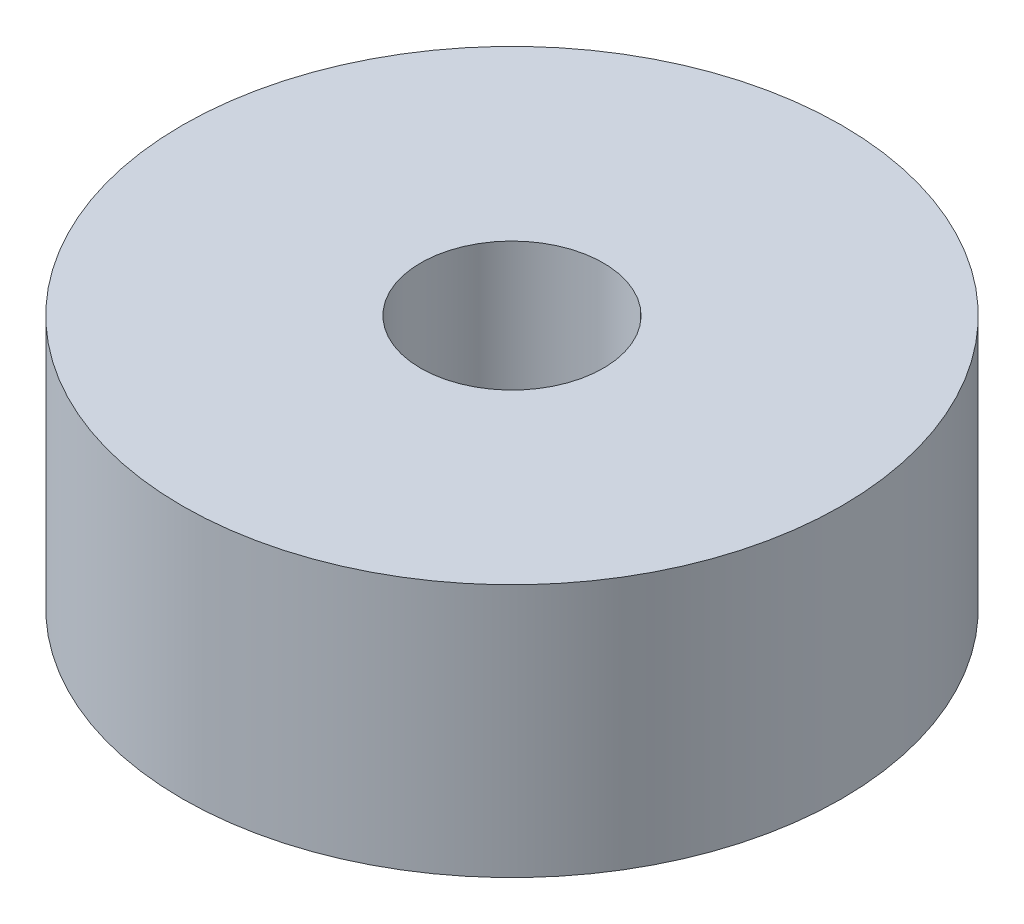
ISO-10303-21;
HEADER;
FILE_DESCRIPTION(('STEP AP214'),'2;1');
FILE_NAME('part.step','',(''),(''),'','','');
FILE_SCHEMA(('AUTOMOTIVE_DESIGN { 1 0 10303 214 1 1 1 1 }'));
ENDSEC;
DATA;
#1=APPLICATION_CONTEXT('core data for automotive mechanical design processes');
#2=APPLICATION_PROTOCOL_DEFINITION('international standard','automotive_design',2000,#1);
#3=PRODUCT_CONTEXT('',#1,'mechanical');
#4=PRODUCT('Part','Part','',(#3));
#5=PRODUCT_RELATED_PRODUCT_CATEGORY('part','',(#4));
#6=PRODUCT_DEFINITION_FORMATION('','',#4);
#7=PRODUCT_DEFINITION_CONTEXT('part definition',#1,'design');
#8=PRODUCT_DEFINITION('design','',#6,#7);
#9=PRODUCT_DEFINITION_SHAPE('','',#8);
#10=(LENGTH_UNIT() NAMED_UNIT(*) SI_UNIT(.MILLI.,.METRE.));
#11=(NAMED_UNIT(*) PLANE_ANGLE_UNIT() SI_UNIT($,.RADIAN.));
#12=(NAMED_UNIT(*) SI_UNIT($,.STERADIAN.) SOLID_ANGLE_UNIT());
#13=UNCERTAINTY_MEASURE_WITH_UNIT(LENGTH_MEASURE(1.E-05),#10,'distance_accuracy_value','');
#14=(GEOMETRIC_REPRESENTATION_CONTEXT(3) GLOBAL_UNCERTAINTY_ASSIGNED_CONTEXT((#13)) GLOBAL_UNIT_ASSIGNED_CONTEXT((#10,
#11,#12)) REPRESENTATION_CONTEXT('',''));
#15=CARTESIAN_POINT('',(0.,0.,0.));
#16=DIRECTION('',(0.,0.,1.));
#17=DIRECTION('',(1.,0.,0.));
#18=AXIS2_PLACEMENT_3D('',#15,#16,#17);
#19=CARTESIAN_POINT('',(0.,5.,0.));
#20=DIRECTION('',(0.,1.,0.));
#21=DIRECTION('',(0.,0.,1.));
#22=AXIS2_PLACEMENT_3D('',#19,#20,#21);
#23=PLANE('',#22);
#24=CARTESIAN_POINT('',(0.,5.,0.));
#25=DIRECTION('',(0.,1.,0.));
#26=DIRECTION('',(0.,0.,1.));
#27=AXIS2_PLACEMENT_3D('',#24,#25,#26);
#28=CIRCLE('',#27,6.5);
#29=CARTESIAN_POINT('',(0.,5.,6.5));
#30=VERTEX_POINT('',#29);
#31=EDGE_CURVE('E10',#30,#30,#28,.T.);
#32=ORIENTED_EDGE('',*,*,#31,.T.);
#33=EDGE_LOOP('',(#32));
#34=FACE_BOUND('',#33,.T.);
#35=CARTESIAN_POINT('',(0.,5.,0.));
#36=DIRECTION('',(0.,1.,0.));
#37=DIRECTION('',(0.,0.,1.));
#38=AXIS2_PLACEMENT_3D('',#35,#36,#37);
#39=CIRCLE('',#38,1.8);
#40=CARTESIAN_POINT('',(0.,5.,1.8));
#41=VERTEX_POINT('',#40);
#42=EDGE_CURVE('E43',#41,#41,#39,.T.);
#43=ORIENTED_EDGE('',*,*,#42,.F.);
#44=EDGE_LOOP('',(#43));
#45=FACE_BOUND('',#44,.T.);
#46=ADVANCED_FACE('F32',(#34,#45),#23,.T.);
#47=CARTESIAN_POINT('',(0.,0.,0.));
#48=DIRECTION('',(0.,1.,0.));
#49=DIRECTION('',(0.,0.,1.));
#50=AXIS2_PLACEMENT_3D('',#47,#48,#49);
#51=PLANE('',#50);
#52=CARTESIAN_POINT('',(0.,0.,0.));
#53=DIRECTION('',(0.,1.,0.));
#54=DIRECTION('',(0.,0.,1.));
#55=AXIS2_PLACEMENT_3D('',#52,#53,#54);
#56=CIRCLE('',#55,6.5);
#57=CARTESIAN_POINT('',(0.,0.,6.5));
#58=VERTEX_POINT('',#57);
#59=EDGE_CURVE('E36',#58,#58,#56,.T.);
#60=ORIENTED_EDGE('',*,*,#59,.F.);
#61=EDGE_LOOP('',(#60));
#62=FACE_BOUND('',#61,.T.);
#63=CARTESIAN_POINT('',(0.,0.,0.));
#64=DIRECTION('',(0.,1.,0.));
#65=DIRECTION('',(0.,0.,1.));
#66=AXIS2_PLACEMENT_3D('',#63,#64,#65);
#67=CIRCLE('',#66,1.8);
#68=CARTESIAN_POINT('',(0.,0.,1.8));
#69=VERTEX_POINT('',#68);
#70=EDGE_CURVE('E45',#69,#69,#67,.T.);
#71=ORIENTED_EDGE('',*,*,#70,.T.);
#72=EDGE_LOOP('',(#71));
#73=FACE_BOUND('',#72,.T.);
#74=ADVANCED_FACE('F55',(#62,#73),#51,.F.);
#75=CARTESIAN_POINT('',(0.,5.,0.));
#76=DIRECTION('',(0.,-1.,0.));
#77=DIRECTION('',(0.,0.,-1.));
#78=AXIS2_PLACEMENT_3D('',#75,#76,#77);
#79=CYLINDRICAL_SURFACE('',#78,6.5);
#80=ORIENTED_EDGE('',*,*,#31,.F.);
#81=EDGE_LOOP('',(#80));
#82=FACE_BOUND('',#81,.T.);
#83=ORIENTED_EDGE('',*,*,#59,.T.);
#84=EDGE_LOOP('',(#83));
#85=FACE_BOUND('',#84,.T.);
#86=ADVANCED_FACE('F34',(#82,#85),#79,.T.);
#87=CARTESIAN_POINT('',(0.,5.,0.));
#88=DIRECTION('',(0.,-1.,0.));
#89=DIRECTION('',(0.,0.,-1.));
#90=AXIS2_PLACEMENT_3D('',#87,#88,#89);
#91=CYLINDRICAL_SURFACE('',#90,1.8);
#92=ORIENTED_EDGE('',*,*,#42,.T.);
#93=EDGE_LOOP('',(#92));
#94=FACE_BOUND('',#93,.T.);
#95=ORIENTED_EDGE('',*,*,#70,.F.);
#96=EDGE_LOOP('',(#95));
#97=FACE_BOUND('',#96,.T.);
#98=ADVANCED_FACE('F51',(#94,#97),#91,.F.);
#99=CLOSED_SHELL('',(#46,#74,#86,#98));
#100=MANIFOLD_SOLID_BREP('B2',#99);
#101=ADVANCED_BREP_SHAPE_REPRESENTATION('',(#18,#100),#14);
#102=SHAPE_DEFINITION_REPRESENTATION(#9,#101);
ENDSEC;
END-ISO-10303-21;
